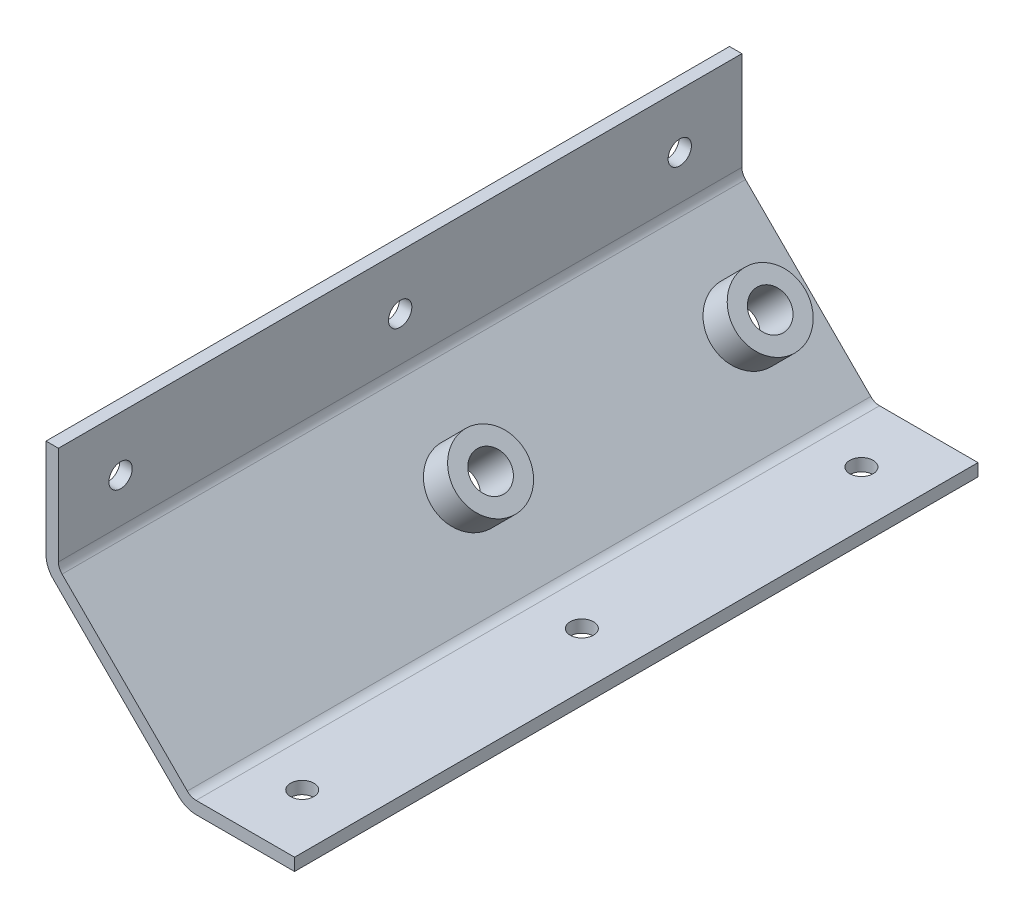
ISO-10303-21;
HEADER;
FILE_DESCRIPTION(('STEP AP214'),'2;1');
FILE_NAME('part.step','',(''),(''),'','','');
FILE_SCHEMA(('AUTOMOTIVE_DESIGN { 1 0 10303 214 1 1 1 1 }'));
ENDSEC;
DATA;
#1=APPLICATION_CONTEXT('core data for automotive mechanical design processes');
#2=APPLICATION_PROTOCOL_DEFINITION('international standard','automotive_design',2000,#1);
#3=PRODUCT_CONTEXT('',#1,'mechanical');
#4=PRODUCT('Part','Part','',(#3));
#5=PRODUCT_RELATED_PRODUCT_CATEGORY('part','',(#4));
#6=PRODUCT_DEFINITION_FORMATION('','',#4);
#7=PRODUCT_DEFINITION_CONTEXT('part definition',#1,'design');
#8=PRODUCT_DEFINITION('design','',#6,#7);
#9=PRODUCT_DEFINITION_SHAPE('','',#8);
#10=(LENGTH_UNIT() NAMED_UNIT(*) SI_UNIT(.MILLI.,.METRE.));
#11=(NAMED_UNIT(*) PLANE_ANGLE_UNIT() SI_UNIT($,.RADIAN.));
#12=(NAMED_UNIT(*) SI_UNIT($,.STERADIAN.) SOLID_ANGLE_UNIT());
#13=UNCERTAINTY_MEASURE_WITH_UNIT(LENGTH_MEASURE(1.E-05),#10,'distance_accuracy_value','');
#14=(GEOMETRIC_REPRESENTATION_CONTEXT(3) GLOBAL_UNCERTAINTY_ASSIGNED_CONTEXT((#13)) GLOBAL_UNIT_ASSIGNED_CONTEXT((#10,
#11,#12)) REPRESENTATION_CONTEXT('',''));
#15=CARTESIAN_POINT('',(0.,0.,0.));
#16=DIRECTION('',(0.,0.,1.));
#17=DIRECTION('',(1.,0.,0.));
#18=AXIS2_PLACEMENT_3D('',#15,#16,#17);
#19=CARTESIAN_POINT('',(5967.28975436411,-6613.31644877753,139.7));
#20=DIRECTION('',(-0.707106781186548,-0.707106781186548,0.));
#21=DIRECTION('',(0.707106781186548,-0.707106781186548,0.));
#22=AXIS2_PLACEMENT_3D('',#19,#20,#21);
#23=PLANE('',#22);
#24=CARTESIAN_POINT('',(5967.28975436284,-6613.31644877626,69.85));
#25=DIRECTION('',(-0.707106781186548,-0.707106781186548,0.));
#26=DIRECTION('',(0.707106781186548,-0.707106781186548,0.));
#27=AXIS2_PLACEMENT_3D('',#24,#25,#26);
#28=CIRCLE('',#27,7.17550000000023);
#29=CARTESIAN_POINT('',(5972.36359907124,-6618.39029348466,69.85));
#30=VERTEX_POINT('',#29);
#31=EDGE_CURVE('E141',#30,#30,#28,.F.);
#32=ORIENTED_EDGE('',*,*,#31,.F.);
#33=EDGE_LOOP('',(#32));
#34=FACE_BOUND('',#33,.T.);
#35=DIRECTION('',(-0.707106781186548,0.707106781186548,0.));
#36=VECTOR('',#35,1.);
#37=CARTESIAN_POINT('',(5967.28975436411,-6613.31644877753,0.));
#38=LINE('',#37,#36);
#39=CARTESIAN_POINT('',(5980.08935681206,-6626.11605122548,0.));
#40=VERTEX_POINT('',#39);
#41=CARTESIAN_POINT('',(5954.49015191489,-6600.51684632831,0.));
#42=VERTEX_POINT('',#41);
#43=EDGE_CURVE('E161',#40,#42,#38,.T.);
#44=ORIENTED_EDGE('',*,*,#43,.T.);
#45=DIRECTION('',(0.,0.,-1.));
#46=VECTOR('',#45,1.);
#47=CARTESIAN_POINT('',(5954.49015191489,-6600.51684632831,139.7));
#48=LINE('',#47,#46);
#49=CARTESIAN_POINT('',(5954.49015191489,-6600.51684632831,139.7));
#50=VERTEX_POINT('',#49);
#51=EDGE_CURVE('E195',#42,#50,#48,.F.);
#52=ORIENTED_EDGE('',*,*,#51,.T.);
#53=DIRECTION('',(-0.707106781186524,0.707106781186571,0.));
#54=VECTOR('',#53,1.);
#55=CARTESIAN_POINT('',(5967.28975436411,-6613.31644877753,139.7));
#56=LINE('',#55,#54);
#57=CARTESIAN_POINT('',(5980.08935681206,-6626.11605122548,139.7));
#58=VERTEX_POINT('',#57);
#59=EDGE_CURVE('E132',#58,#50,#56,.T.);
#60=ORIENTED_EDGE('',*,*,#59,.F.);
#61=DIRECTION('',(0.,0.,-1.));
#62=VECTOR('',#61,1.);
#63=CARTESIAN_POINT('',(5980.08935681206,-6626.11605122548,0.));
#64=LINE('',#63,#62);
#65=EDGE_CURVE('E192',#58,#40,#64,.T.);
#66=ORIENTED_EDGE('',*,*,#65,.T.);
#67=EDGE_LOOP('',(#44,#52,#60,#66));
#68=FACE_BOUND('',#67,.T.);
#69=CARTESIAN_POINT('',(5967.28975436284,-6613.31644877626,12.7));
#70=DIRECTION('',(-0.707106781186548,-0.707106781186548,0.));
#71=DIRECTION('',(0.707106781186548,-0.707106781186548,0.));
#72=AXIS2_PLACEMENT_3D('',#69,#70,#71);
#73=CIRCLE('',#72,7.17550000000023);
#74=CARTESIAN_POINT('',(5972.36359907124,-6618.39029348466,12.7));
#75=VERTEX_POINT('',#74);
#76=EDGE_CURVE('E187',#75,#75,#73,.F.);
#77=ORIENTED_EDGE('',*,*,#76,.F.);
#78=EDGE_LOOP('',(#77));
#79=FACE_BOUND('',#78,.T.);
#80=ADVANCED_FACE('F30',(#34,#68,#79),#23,.F.);
#81=CARTESIAN_POINT('',(5953.7462031391,-6578.6,139.7));
#82=DIRECTION('',(-1.,0.,0.));
#83=DIRECTION('',(0.,0.,1.));
#84=AXIS2_PLACEMENT_3D('',#81,#82,#83);
#85=PLANE('',#84);
#86=CARTESIAN_POINT('',(5953.7462031391,-6589.7252,12.7));
#87=DIRECTION('',(-1.,0.,0.));
#88=DIRECTION('',(0.,0.,1.));
#89=AXIS2_PLACEMENT_3D('',#86,#87,#88);
#90=CIRCLE('',#89,2.38759999999989);
#91=CARTESIAN_POINT('',(5953.7462031391,-6589.7252,15.0875999999999));
#92=VERTEX_POINT('',#91);
#93=EDGE_CURVE('E529',#92,#92,#90,.F.);
#94=ORIENTED_EDGE('',*,*,#93,.F.);
#95=EDGE_LOOP('',(#94));
#96=FACE_BOUND('',#95,.T.);
#97=CARTESIAN_POINT('',(5953.7462031391,-6589.7252,69.85));
#98=DIRECTION('',(-1.,0.,0.));
#99=DIRECTION('',(0.,0.,1.));
#100=AXIS2_PLACEMENT_3D('',#97,#98,#99);
#101=CIRCLE('',#100,2.3875999999999);
#102=CARTESIAN_POINT('',(5953.7462031391,-6589.7252,72.2375999999999));
#103=VERTEX_POINT('',#102);
#104=EDGE_CURVE('E523',#103,#103,#101,.F.);
#105=ORIENTED_EDGE('',*,*,#104,.F.);
#106=EDGE_LOOP('',(#105));
#107=FACE_BOUND('',#106,.T.);
#108=CARTESIAN_POINT('',(5953.7462031391,-6589.7252,127.));
#109=DIRECTION('',(-1.,0.,0.));
#110=DIRECTION('',(0.,0.,1.));
#111=AXIS2_PLACEMENT_3D('',#108,#109,#110);
#112=CIRCLE('',#111,2.38759999999988);
#113=CARTESIAN_POINT('',(5953.7462031391,-6589.7252,129.3876));
#114=VERTEX_POINT('',#113);
#115=EDGE_CURVE('E517',#114,#114,#112,.F.);
#116=ORIENTED_EDGE('',*,*,#115,.F.);
#117=EDGE_LOOP('',(#116));
#118=FACE_BOUND('',#117,.T.);
#119=DIRECTION('',(0.,1.,0.));
#120=VECTOR('',#119,1.);
#121=CARTESIAN_POINT('',(5953.7462031391,-6578.6,139.7));
#122=LINE('',#121,#120);
#123=CARTESIAN_POINT('',(5953.7462031391,-6598.72079510409,139.7));
#124=VERTEX_POINT('',#123);
#125=CARTESIAN_POINT('',(5953.7462031391,-6578.6,139.7));
#126=VERTEX_POINT('',#125);
#127=EDGE_CURVE('E120',#124,#126,#122,.T.);
#128=ORIENTED_EDGE('',*,*,#127,.F.);
#129=DIRECTION('',(0.,0.,-1.));
#130=VECTOR('',#129,1.);
#131=CARTESIAN_POINT('',(5953.7462031391,-6598.72079510409,0.));
#132=LINE('',#131,#130);
#133=CARTESIAN_POINT('',(5953.7462031391,-6598.72079510409,0.));
#134=VERTEX_POINT('',#133);
#135=EDGE_CURVE('E190',#124,#134,#132,.T.);
#136=ORIENTED_EDGE('',*,*,#135,.T.);
#137=DIRECTION('',(0.,1.,0.));
#138=VECTOR('',#137,1.);
#139=CARTESIAN_POINT('',(5953.7462031391,-6578.6,0.));
#140=LINE('',#139,#138);
#141=CARTESIAN_POINT('',(5953.7462031391,-6578.6,0.));
#142=VERTEX_POINT('',#141);
#143=EDGE_CURVE('E138',#134,#142,#140,.T.);
#144=ORIENTED_EDGE('',*,*,#143,.T.);
#145=DIRECTION('',(0.,0.,-1.));
#146=VECTOR('',#145,1.);
#147=CARTESIAN_POINT('',(5953.7462031391,-6578.6,139.7));
#148=LINE('',#147,#146);
#149=EDGE_CURVE('E135',#126,#142,#148,.T.);
#150=ORIENTED_EDGE('',*,*,#149,.F.);
#151=EDGE_LOOP('',(#128,#136,#144,#150));
#152=FACE_BOUND('',#151,.T.);
#153=ADVANCED_FACE('F136',(#96,#107,#118,#152),#85,.F.);
#154=CARTESIAN_POINT('',(5951.2062031391,-6578.6,139.7));
#155=DIRECTION('',(0.,-1.,0.));
#156=DIRECTION('',(0.,0.,-1.));
#157=AXIS2_PLACEMENT_3D('',#154,#155,#156);
#158=PLANE('',#157);
#159=DIRECTION('',(-1.,0.,0.));
#160=VECTOR('',#159,1.);
#161=CARTESIAN_POINT('',(5951.2062031391,-6578.6,0.));
#162=LINE('',#161,#160);
#163=CARTESIAN_POINT('',(5951.2062031391,-6578.6,0.));
#164=VERTEX_POINT('',#163);
#165=EDGE_CURVE('E166',#142,#164,#162,.T.);
#166=ORIENTED_EDGE('',*,*,#165,.T.);
#167=DIRECTION('',(0.,0.,-1.));
#168=VECTOR('',#167,1.);
#169=CARTESIAN_POINT('',(5951.2062031391,-6578.6,139.7));
#170=LINE('',#169,#168);
#171=CARTESIAN_POINT('',(5951.2062031391,-6578.6,139.7));
#172=VERTEX_POINT('',#171);
#173=EDGE_CURVE('E142',#172,#164,#170,.T.);
#174=ORIENTED_EDGE('',*,*,#173,.F.);
#175=DIRECTION('',(-1.,0.,0.));
#176=VECTOR('',#175,1.);
#177=CARTESIAN_POINT('',(5951.2062031391,-6578.6,139.7));
#178=LINE('',#177,#176);
#179=EDGE_CURVE('E124',#126,#172,#178,.T.);
#180=ORIENTED_EDGE('',*,*,#179,.F.);
#181=ORIENTED_EDGE('',*,*,#149,.T.);
#182=EDGE_LOOP('',(#166,#174,#180,#181));
#183=FACE_BOUND('',#182,.T.);
#184=ADVANCED_FACE('F144',(#183),#158,.F.);
#185=CARTESIAN_POINT('',(5951.2062031391,-6578.6,139.7));
#186=DIRECTION('',(1.,0.,0.));
#187=DIRECTION('',(0.,0.,-1.));
#188=AXIS2_PLACEMENT_3D('',#185,#186,#187);
#189=PLANE('',#188);
#190=CARTESIAN_POINT('',(5951.2062031391,-6589.7252,12.7));
#191=DIRECTION('',(-1.,0.,0.));
#192=DIRECTION('',(0.,0.,1.));
#193=AXIS2_PLACEMENT_3D('',#190,#191,#192);
#194=CIRCLE('',#193,2.38759999999989);
#195=CARTESIAN_POINT('',(5951.2062031391,-6589.7252,15.0875999999999));
#196=VERTEX_POINT('',#195);
#197=EDGE_CURVE('E532',#196,#196,#194,.T.);
#198=ORIENTED_EDGE('',*,*,#197,.F.);
#199=EDGE_LOOP('',(#198));
#200=FACE_BOUND('',#199,.T.);
#201=CARTESIAN_POINT('',(5951.2062031391,-6589.7252,69.85));
#202=DIRECTION('',(-1.,0.,0.));
#203=DIRECTION('',(0.,0.,1.));
#204=AXIS2_PLACEMENT_3D('',#201,#202,#203);
#205=CIRCLE('',#204,2.3875999999999);
#206=CARTESIAN_POINT('',(5951.2062031391,-6589.7252,72.2375999999999));
#207=VERTEX_POINT('',#206);
#208=EDGE_CURVE('E526',#207,#207,#205,.T.);
#209=ORIENTED_EDGE('',*,*,#208,.F.);
#210=EDGE_LOOP('',(#209));
#211=FACE_BOUND('',#210,.T.);
#212=CARTESIAN_POINT('',(5951.2062031391,-6589.7252,127.));
#213=DIRECTION('',(-1.,0.,0.));
#214=DIRECTION('',(0.,0.,1.));
#215=AXIS2_PLACEMENT_3D('',#212,#213,#214);
#216=CIRCLE('',#215,2.38759999999988);
#217=CARTESIAN_POINT('',(5951.2062031391,-6589.7252,129.3876));
#218=VERTEX_POINT('',#217);
#219=EDGE_CURVE('E520',#218,#218,#216,.T.);
#220=ORIENTED_EDGE('',*,*,#219,.F.);
#221=EDGE_LOOP('',(#220));
#222=FACE_BOUND('',#221,.T.);
#223=DIRECTION('',(0.,-1.,0.));
#224=VECTOR('',#223,1.);
#225=CARTESIAN_POINT('',(5951.2062031391,-6578.6,0.));
#226=LINE('',#225,#224);
#227=CARTESIAN_POINT('',(5951.2062031391,-6598.72079510314,0.));
#228=VERTEX_POINT('',#227);
#229=EDGE_CURVE('E168',#164,#228,#226,.T.);
#230=ORIENTED_EDGE('',*,*,#229,.T.);
#231=DIRECTION('',(0.,0.,-1.));
#232=VECTOR('',#231,1.);
#233=CARTESIAN_POINT('',(5951.2062031391,-6598.72079510314,139.7));
#234=LINE('',#233,#232);
#235=CARTESIAN_POINT('',(5951.2062031391,-6598.72079510314,139.7));
#236=VERTEX_POINT('',#235);
#237=EDGE_CURVE('E11',#228,#236,#234,.F.);
#238=ORIENTED_EDGE('',*,*,#237,.T.);
#239=DIRECTION('',(0.,-1.,0.));
#240=VECTOR('',#239,1.);
#241=CARTESIAN_POINT('',(5951.2062031391,-6578.6,139.7));
#242=LINE('',#241,#240);
#243=EDGE_CURVE('E146',#172,#236,#242,.T.);
#244=ORIENTED_EDGE('',*,*,#243,.F.);
#245=ORIENTED_EDGE('',*,*,#173,.T.);
#246=EDGE_LOOP('',(#230,#238,#244,#245));
#247=FACE_BOUND('',#246,.T.);
#248=ADVANCED_FACE('F237',(#200,#211,#222,#247),#189,.F.);
#249=CARTESIAN_POINT('',(5979.7812031391,-6629.4,139.7));
#250=DIRECTION('',(0.707106781186548,0.707106781186548,0.));
#251=DIRECTION('',(-0.707106781186548,0.707106781186548,0.));
#252=AXIS2_PLACEMENT_3D('',#249,#250,#251);
#253=PLANE('',#252);
#254=CARTESIAN_POINT('',(5965.4937031391,-6615.1125,12.7));
#255=DIRECTION('',(-0.707106781186548,-0.707106781186547,0.));
#256=DIRECTION('',(0.707106781186547,-0.707106781186548,0.));
#257=AXIS2_PLACEMENT_3D('',#254,#255,#256);
#258=CIRCLE('',#257,3.81000000000022);
#259=CARTESIAN_POINT('',(5968.18777997542,-6617.80657683632,12.7));
#260=VERTEX_POINT('',#259);
#261=EDGE_CURVE('E538',#260,#260,#258,.T.);
#262=ORIENTED_EDGE('',*,*,#261,.F.);
#263=EDGE_LOOP('',(#262));
#264=FACE_BOUND('',#263,.T.);
#265=CARTESIAN_POINT('',(5965.4937031391,-6615.1125,69.85));
#266=DIRECTION('',(-0.707106781186548,-0.707106781186547,0.));
#267=DIRECTION('',(0.707106781186547,-0.707106781186548,0.));
#268=AXIS2_PLACEMENT_3D('',#265,#266,#267);
#269=CIRCLE('',#268,3.81000000000022);
#270=CARTESIAN_POINT('',(5968.18777997542,-6617.80657683632,69.85));
#271=VERTEX_POINT('',#270);
#272=EDGE_CURVE('E535',#271,#271,#269,.T.);
#273=ORIENTED_EDGE('',*,*,#272,.F.);
#274=EDGE_LOOP('',(#273));
#275=FACE_BOUND('',#274,.T.);
#276=DIRECTION('',(0.707106781186547,-0.707106781186547,0.));
#277=VECTOR('',#276,1.);
#278=CARTESIAN_POINT('',(5979.7812031391,-6629.4,0.));
#279=LINE('',#278,#277);
#280=CARTESIAN_POINT('',(5952.69410069067,-6602.31289755157,0.));
#281=VERTEX_POINT('',#280);
#282=CARTESIAN_POINT('',(5978.29330558753,-6627.91210244843,0.));
#283=VERTEX_POINT('',#282);
#284=EDGE_CURVE('E170',#281,#283,#279,.T.);
#285=ORIENTED_EDGE('',*,*,#284,.T.);
#286=DIRECTION('',(0.,0.,-1.));
#287=VECTOR('',#286,1.);
#288=CARTESIAN_POINT('',(5978.29330558753,-6627.91210244843,139.7));
#289=LINE('',#288,#287);
#290=CARTESIAN_POINT('',(5978.29330558753,-6627.91210244843,139.7));
#291=VERTEX_POINT('',#290);
#292=EDGE_CURVE('E51',#283,#291,#289,.F.);
#293=ORIENTED_EDGE('',*,*,#292,.T.);
#294=DIRECTION('',(0.707106781186547,-0.707106781186547,0.));
#295=VECTOR('',#294,1.);
#296=CARTESIAN_POINT('',(5979.7812031391,-6629.4,139.7));
#297=LINE('',#296,#295);
#298=CARTESIAN_POINT('',(5952.69410069067,-6602.31289755157,139.7));
#299=VERTEX_POINT('',#298);
#300=EDGE_CURVE('E148',#299,#291,#297,.T.);
#301=ORIENTED_EDGE('',*,*,#300,.F.);
#302=DIRECTION('',(0.,0.,-1.));
#303=VECTOR('',#302,1.);
#304=CARTESIAN_POINT('',(5952.69410069067,-6602.31289755157,139.7));
#305=LINE('',#304,#303);
#306=EDGE_CURVE('E213',#299,#281,#305,.T.);
#307=ORIENTED_EDGE('',*,*,#306,.T.);
#308=EDGE_LOOP('',(#285,#293,#301,#307));
#309=FACE_BOUND('',#308,.T.);
#310=ADVANCED_FACE('F232',(#264,#275,#309),#253,.F.);
#311=CARTESIAN_POINT('',(5979.7812031391,-6629.4,139.7));
#312=DIRECTION('',(0.,1.,0.));
#313=DIRECTION('',(0.,0.,1.));
#314=AXIS2_PLACEMENT_3D('',#311,#312,#313);
#315=PLANE('',#314);
#316=CARTESIAN_POINT('',(5990.8810031391,-6629.4,12.7));
#317=DIRECTION('',(0.,-1.,0.));
#318=DIRECTION('',(0.,0.,-1.));
#319=AXIS2_PLACEMENT_3D('',#316,#317,#318);
#320=CIRCLE('',#319,2.38759999999948);
#321=CARTESIAN_POINT('',(5990.8810031391,-6629.4,10.3124000000005));
#322=VERTEX_POINT('',#321);
#323=EDGE_CURVE('E514',#322,#322,#320,.T.);
#324=ORIENTED_EDGE('',*,*,#323,.F.);
#325=EDGE_LOOP('',(#324));
#326=FACE_BOUND('',#325,.T.);
#327=CARTESIAN_POINT('',(5990.8810031391,-6629.4,69.85));
#328=DIRECTION('',(0.,-1.,0.));
#329=DIRECTION('',(0.,0.,-1.));
#330=AXIS2_PLACEMENT_3D('',#327,#328,#329);
#331=CIRCLE('',#330,2.38759999999948);
#332=CARTESIAN_POINT('',(5990.8810031391,-6629.4,67.4624000000005));
#333=VERTEX_POINT('',#332);
#334=EDGE_CURVE('E508',#333,#333,#331,.T.);
#335=ORIENTED_EDGE('',*,*,#334,.F.);
#336=EDGE_LOOP('',(#335));
#337=FACE_BOUND('',#336,.T.);
#338=CARTESIAN_POINT('',(5990.8810031391,-6629.4,127.));
#339=DIRECTION('',(0.,-1.,0.));
#340=DIRECTION('',(0.,0.,-1.));
#341=AXIS2_PLACEMENT_3D('',#338,#339,#340);
#342=CIRCLE('',#341,2.38759999999948);
#343=CARTESIAN_POINT('',(5990.8810031391,-6629.4,124.612400000001));
#344=VERTEX_POINT('',#343);
#345=EDGE_CURVE('E502',#344,#344,#342,.T.);
#346=ORIENTED_EDGE('',*,*,#345,.F.);
#347=EDGE_LOOP('',(#346));
#348=FACE_BOUND('',#347,.T.);
#349=DIRECTION('',(1.,0.,0.));
#350=VECTOR('',#349,1.);
#351=CARTESIAN_POINT('',(5979.7812031391,-6629.4,139.7));
#352=LINE('',#351,#350);
#353=CARTESIAN_POINT('',(5981.88540803595,-6629.4,139.7));
#354=VERTEX_POINT('',#353);
#355=CARTESIAN_POINT('',(6002.0062031391,-6629.4,139.7));
#356=VERTEX_POINT('',#355);
#357=EDGE_CURVE('E153',#354,#356,#352,.T.);
#358=ORIENTED_EDGE('',*,*,#357,.F.);
#359=DIRECTION('',(0.,0.,-1.));
#360=VECTOR('',#359,1.);
#361=CARTESIAN_POINT('',(5981.88540803595,-6629.4,139.7));
#362=LINE('',#361,#360);
#363=CARTESIAN_POINT('',(5981.88540803595,-6629.4,0.));
#364=VERTEX_POINT('',#363);
#365=EDGE_CURVE('E206',#354,#364,#362,.T.);
#366=ORIENTED_EDGE('',*,*,#365,.T.);
#367=DIRECTION('',(1.,0.,0.));
#368=VECTOR('',#367,1.);
#369=CARTESIAN_POINT('',(5979.7812031391,-6629.4,0.));
#370=LINE('',#369,#368);
#371=CARTESIAN_POINT('',(6002.0062031391,-6629.4,0.));
#372=VERTEX_POINT('',#371);
#373=EDGE_CURVE('E172',#364,#372,#370,.T.);
#374=ORIENTED_EDGE('',*,*,#373,.T.);
#375=DIRECTION('',(0.,0.,-1.));
#376=VECTOR('',#375,1.);
#377=CARTESIAN_POINT('',(6002.0062031391,-6629.4,139.7));
#378=LINE('',#377,#376);
#379=EDGE_CURVE('E181',#356,#372,#378,.T.);
#380=ORIENTED_EDGE('',*,*,#379,.F.);
#381=EDGE_LOOP('',(#358,#366,#374,#380));
#382=FACE_BOUND('',#381,.T.);
#383=ADVANCED_FACE('F224',(#326,#337,#348,#382),#315,.F.);
#384=CARTESIAN_POINT('',(6002.0062031391,-6626.86000000127,139.7));
#385=DIRECTION('',(-1.,0.,0.));
#386=DIRECTION('',(0.,0.,1.));
#387=AXIS2_PLACEMENT_3D('',#384,#385,#386);
#388=PLANE('',#387);
#389=DIRECTION('',(0.,1.,0.));
#390=VECTOR('',#389,1.);
#391=CARTESIAN_POINT('',(6002.0062031391,-6626.86000000127,0.));
#392=LINE('',#391,#390);
#393=CARTESIAN_POINT('',(6002.0062031391,-6626.86000000127,0.));
#394=VERTEX_POINT('',#393);
#395=EDGE_CURVE('E174',#372,#394,#392,.T.);
#396=ORIENTED_EDGE('',*,*,#395,.T.);
#397=DIRECTION('',(0.,0.,-1.));
#398=VECTOR('',#397,1.);
#399=CARTESIAN_POINT('',(6002.0062031391,-6626.86000000127,139.7));
#400=LINE('',#399,#398);
#401=CARTESIAN_POINT('',(6002.0062031391,-6626.86000000127,139.7));
#402=VERTEX_POINT('',#401);
#403=EDGE_CURVE('E160',#402,#394,#400,.T.);
#404=ORIENTED_EDGE('',*,*,#403,.F.);
#405=DIRECTION('',(0.,1.,0.));
#406=VECTOR('',#405,1.);
#407=CARTESIAN_POINT('',(6002.0062031391,-6626.86000000127,139.7));
#408=LINE('',#407,#406);
#409=EDGE_CURVE('E155',#356,#402,#408,.T.);
#410=ORIENTED_EDGE('',*,*,#409,.F.);
#411=ORIENTED_EDGE('',*,*,#379,.T.);
#412=EDGE_LOOP('',(#396,#404,#410,#411));
#413=FACE_BOUND('',#412,.T.);
#414=ADVANCED_FACE('F311',(#413),#388,.F.);
#415=CARTESIAN_POINT('',(5980.83330558785,-6626.86000000127,139.7));
#416=DIRECTION('',(0.,-1.,0.));
#417=DIRECTION('',(0.,0.,-1.));
#418=AXIS2_PLACEMENT_3D('',#415,#416,#417);
#419=PLANE('',#418);
#420=CARTESIAN_POINT('',(5990.8810031391,-6626.86000000127,12.7));
#421=DIRECTION('',(0.,-1.,0.));
#422=DIRECTION('',(0.,0.,-1.));
#423=AXIS2_PLACEMENT_3D('',#420,#421,#422);
#424=CIRCLE('',#423,2.38759999999948);
#425=CARTESIAN_POINT('',(5990.8810031391,-6626.86000000127,10.3124000000005));
#426=VERTEX_POINT('',#425);
#427=EDGE_CURVE('E511',#426,#426,#424,.F.);
#428=ORIENTED_EDGE('',*,*,#427,.F.);
#429=EDGE_LOOP('',(#428));
#430=FACE_BOUND('',#429,.T.);
#431=CARTESIAN_POINT('',(5990.8810031391,-6626.86000000127,69.85));
#432=DIRECTION('',(0.,-1.,0.));
#433=DIRECTION('',(0.,0.,-1.));
#434=AXIS2_PLACEMENT_3D('',#431,#432,#433);
#435=CIRCLE('',#434,2.38759999999948);
#436=CARTESIAN_POINT('',(5990.8810031391,-6626.86000000127,67.4624000000005));
#437=VERTEX_POINT('',#436);
#438=EDGE_CURVE('E505',#437,#437,#435,.F.);
#439=ORIENTED_EDGE('',*,*,#438,.F.);
#440=EDGE_LOOP('',(#439));
#441=FACE_BOUND('',#440,.T.);
#442=CARTESIAN_POINT('',(5990.8810031391,-6626.86000000127,127.));
#443=DIRECTION('',(0.,-1.,0.));
#444=DIRECTION('',(0.,0.,-1.));
#445=AXIS2_PLACEMENT_3D('',#442,#443,#444);
#446=CIRCLE('',#445,2.38759999999948);
#447=CARTESIAN_POINT('',(5990.8810031391,-6626.86000000127,124.612400000001));
#448=VERTEX_POINT('',#447);
#449=EDGE_CURVE('E164',#448,#448,#446,.F.);
#450=ORIENTED_EDGE('',*,*,#449,.F.);
#451=EDGE_LOOP('',(#450));
#452=FACE_BOUND('',#451,.T.);
#453=DIRECTION('',(-1.,0.,0.));
#454=VECTOR('',#453,1.);
#455=CARTESIAN_POINT('',(5980.83330558785,-6626.86000000127,0.));
#456=LINE('',#455,#454);
#457=CARTESIAN_POINT('',(5981.88540803628,-6626.86000000127,0.));
#458=VERTEX_POINT('',#457);
#459=EDGE_CURVE('E176',#394,#458,#456,.T.);
#460=ORIENTED_EDGE('',*,*,#459,.T.);
#461=DIRECTION('',(0.,0.,-1.));
#462=VECTOR('',#461,1.);
#463=CARTESIAN_POINT('',(5981.88540803628,-6626.86000000127,139.7));
#464=LINE('',#463,#462);
#465=CARTESIAN_POINT('',(5981.88540803628,-6626.86000000127,139.7));
#466=VERTEX_POINT('',#465);
#467=EDGE_CURVE('E197',#458,#466,#464,.F.);
#468=ORIENTED_EDGE('',*,*,#467,.T.);
#469=DIRECTION('',(-1.,0.,0.));
#470=VECTOR('',#469,1.);
#471=CARTESIAN_POINT('',(5980.83330558785,-6626.86000000127,139.7));
#472=LINE('',#471,#470);
#473=EDGE_CURVE('E157',#402,#466,#472,.T.);
#474=ORIENTED_EDGE('',*,*,#473,.F.);
#475=ORIENTED_EDGE('',*,*,#403,.T.);
#476=EDGE_LOOP('',(#460,#468,#474,#475));
#477=FACE_BOUND('',#476,.T.);
#478=ADVANCED_FACE('F300',(#430,#441,#452,#477),#419,.F.);
#479=CARTESIAN_POINT('',(5980.83330558785,-6626.86000000127,139.7));
#480=DIRECTION('',(0.,0.,1.));
#481=DIRECTION('',(1.,0.,0.));
#482=AXIS2_PLACEMENT_3D('',#479,#480,#481);
#483=PLANE('',#482);
#484=ORIENTED_EDGE('',*,*,#300,.T.);
#485=CARTESIAN_POINT('',(5981.88540803595,-6624.32,139.7));
#486=DIRECTION('',(0.,0.,1.));
#487=DIRECTION('',(1.,0.,0.));
#488=AXIS2_PLACEMENT_3D('',#485,#486,#487);
#489=CIRCLE('',#488,5.08);
#490=EDGE_CURVE('E38',#291,#354,#489,.T.);
#491=ORIENTED_EDGE('',*,*,#490,.T.);
#492=ORIENTED_EDGE('',*,*,#357,.T.);
#493=ORIENTED_EDGE('',*,*,#409,.T.);
#494=ORIENTED_EDGE('',*,*,#473,.T.);
#495=CARTESIAN_POINT('',(5981.88540803628,-6624.32000000127,139.7));
#496=DIRECTION('',(0.,0.,1.));
#497=DIRECTION('',(1.,0.,0.));
#498=AXIS2_PLACEMENT_3D('',#495,#496,#497);
#499=CIRCLE('',#498,2.54);
#500=EDGE_CURVE('E204',#466,#58,#499,.F.);
#501=ORIENTED_EDGE('',*,*,#500,.T.);
#502=ORIENTED_EDGE('',*,*,#59,.T.);
#503=CARTESIAN_POINT('',(5956.2862031391,-6598.72079510409,139.7));
#504=DIRECTION('',(0.,0.,1.));
#505=DIRECTION('',(1.,0.,0.));
#506=AXIS2_PLACEMENT_3D('',#503,#504,#505);
#507=CIRCLE('',#506,2.54);
#508=EDGE_CURVE('E128',#50,#124,#507,.F.);
#509=ORIENTED_EDGE('',*,*,#508,.T.);
#510=ORIENTED_EDGE('',*,*,#127,.T.);
#511=ORIENTED_EDGE('',*,*,#179,.T.);
#512=ORIENTED_EDGE('',*,*,#243,.T.);
#513=CARTESIAN_POINT('',(5956.2862031391,-6598.72079510314,139.7));
#514=DIRECTION('',(0.,0.,1.));
#515=DIRECTION('',(1.,0.,0.));
#516=AXIS2_PLACEMENT_3D('',#513,#514,#515);
#517=CIRCLE('',#516,5.08);
#518=EDGE_CURVE('E217',#236,#299,#517,.T.);
#519=ORIENTED_EDGE('',*,*,#518,.T.);
#520=EDGE_LOOP('',(#484,#491,#492,#493,#494,#501,#502,#509,#510,#511,#512,#519));
#521=FACE_BOUND('',#520,.T.);
#522=ADVANCED_FACE('F122',(#521),#483,.T.);
#523=CARTESIAN_POINT('',(5980.83330558785,-6626.86000000127,0.));
#524=DIRECTION('',(0.,0.,1.));
#525=DIRECTION('',(1.,0.,0.));
#526=AXIS2_PLACEMENT_3D('',#523,#524,#525);
#527=PLANE('',#526);
#528=ORIENTED_EDGE('',*,*,#373,.F.);
#529=CARTESIAN_POINT('',(5981.88540803595,-6624.32,0.));
#530=DIRECTION('',(0.,0.,1.));
#531=DIRECTION('',(1.,0.,0.));
#532=AXIS2_PLACEMENT_3D('',#529,#530,#531);
#533=CIRCLE('',#532,5.08);
#534=EDGE_CURVE('E211',#364,#283,#533,.F.);
#535=ORIENTED_EDGE('',*,*,#534,.T.);
#536=ORIENTED_EDGE('',*,*,#284,.F.);
#537=CARTESIAN_POINT('',(5956.2862031391,-6598.72079510314,0.));
#538=DIRECTION('',(0.,0.,1.));
#539=DIRECTION('',(1.,0.,0.));
#540=AXIS2_PLACEMENT_3D('',#537,#538,#539);
#541=CIRCLE('',#540,5.08);
#542=EDGE_CURVE('E209',#281,#228,#541,.F.);
#543=ORIENTED_EDGE('',*,*,#542,.T.);
#544=ORIENTED_EDGE('',*,*,#229,.F.);
#545=ORIENTED_EDGE('',*,*,#165,.F.);
#546=ORIENTED_EDGE('',*,*,#143,.F.);
#547=CARTESIAN_POINT('',(5956.2862031391,-6598.72079510409,0.));
#548=DIRECTION('',(0.,0.,1.));
#549=DIRECTION('',(1.,0.,0.));
#550=AXIS2_PLACEMENT_3D('',#547,#548,#549);
#551=CIRCLE('',#550,2.54);
#552=EDGE_CURVE('E199',#134,#42,#551,.T.);
#553=ORIENTED_EDGE('',*,*,#552,.T.);
#554=ORIENTED_EDGE('',*,*,#43,.F.);
#555=CARTESIAN_POINT('',(5981.88540803628,-6624.32000000127,0.));
#556=DIRECTION('',(0.,0.,1.));
#557=DIRECTION('',(1.,0.,0.));
#558=AXIS2_PLACEMENT_3D('',#555,#556,#557);
#559=CIRCLE('',#558,2.54);
#560=EDGE_CURVE('E202',#40,#458,#559,.T.);
#561=ORIENTED_EDGE('',*,*,#560,.T.);
#562=ORIENTED_EDGE('',*,*,#459,.F.);
#563=ORIENTED_EDGE('',*,*,#395,.F.);
#564=EDGE_LOOP('',(#528,#535,#536,#543,#544,#545,#546,#553,#554,#561,#562,#563));
#565=FACE_BOUND('',#564,.T.);
#566=ADVANCED_FACE('F230',(#565),#527,.F.);
#567=CARTESIAN_POINT('',(5990.8810031391,-6620.10684739823,127.));
#568=DIRECTION('',(0.,-1.,0.));
#569=DIRECTION('',(0.,0.,-1.));
#570=AXIS2_PLACEMENT_3D('',#567,#568,#569);
#571=CYLINDRICAL_SURFACE('',#570,2.38759999999948);
#572=ORIENTED_EDGE('',*,*,#449,.T.);
#573=EDGE_LOOP('',(#572));
#574=FACE_BOUND('',#573,.T.);
#575=ORIENTED_EDGE('',*,*,#345,.T.);
#576=EDGE_LOOP('',(#575));
#577=FACE_BOUND('',#576,.T.);
#578=ADVANCED_FACE('F289',(#574,#577),#571,.F.);
#579=CARTESIAN_POINT('',(5990.8810031391,-6620.10684739823,69.85));
#580=DIRECTION('',(0.,-1.,0.));
#581=DIRECTION('',(0.,0.,-1.));
#582=AXIS2_PLACEMENT_3D('',#579,#580,#581);
#583=CYLINDRICAL_SURFACE('',#582,2.38759999999948);
#584=ORIENTED_EDGE('',*,*,#438,.T.);
#585=EDGE_LOOP('',(#584));
#586=FACE_BOUND('',#585,.T.);
#587=ORIENTED_EDGE('',*,*,#334,.T.);
#588=EDGE_LOOP('',(#587));
#589=FACE_BOUND('',#588,.T.);
#590=ADVANCED_FACE('F455',(#586,#589),#583,.F.);
#591=CARTESIAN_POINT('',(5990.8810031391,-6620.10684739823,12.7));
#592=DIRECTION('',(0.,-1.,0.));
#593=DIRECTION('',(0.,0.,-1.));
#594=AXIS2_PLACEMENT_3D('',#591,#592,#593);
#595=CYLINDRICAL_SURFACE('',#594,2.38759999999948);
#596=ORIENTED_EDGE('',*,*,#427,.T.);
#597=EDGE_LOOP('',(#596));
#598=FACE_BOUND('',#597,.T.);
#599=ORIENTED_EDGE('',*,*,#323,.T.);
#600=EDGE_LOOP('',(#599));
#601=FACE_BOUND('',#600,.T.);
#602=ADVANCED_FACE('F445',(#598,#601),#595,.F.);
#603=CARTESIAN_POINT('',(5960.49935574214,-6589.7252,127.));
#604=DIRECTION('',(-1.,0.,0.));
#605=DIRECTION('',(0.,0.,1.));
#606=AXIS2_PLACEMENT_3D('',#603,#604,#605);
#607=CYLINDRICAL_SURFACE('',#606,2.38759999999988);
#608=ORIENTED_EDGE('',*,*,#115,.T.);
#609=EDGE_LOOP('',(#608));
#610=FACE_BOUND('',#609,.T.);
#611=ORIENTED_EDGE('',*,*,#219,.T.);
#612=EDGE_LOOP('',(#611));
#613=FACE_BOUND('',#612,.T.);
#614=ADVANCED_FACE('F435',(#610,#613),#607,.F.);
#615=CARTESIAN_POINT('',(5960.49935574214,-6589.7252,69.85));
#616=DIRECTION('',(-1.,0.,0.));
#617=DIRECTION('',(0.,0.,1.));
#618=AXIS2_PLACEMENT_3D('',#615,#616,#617);
#619=CYLINDRICAL_SURFACE('',#618,2.3875999999999);
#620=ORIENTED_EDGE('',*,*,#104,.T.);
#621=EDGE_LOOP('',(#620));
#622=FACE_BOUND('',#621,.T.);
#623=ORIENTED_EDGE('',*,*,#208,.T.);
#624=EDGE_LOOP('',(#623));
#625=FACE_BOUND('',#624,.T.);
#626=ADVANCED_FACE('F425',(#622,#625),#619,.F.);
#627=CARTESIAN_POINT('',(5960.49935574214,-6589.7252,12.7));
#628=DIRECTION('',(-1.,0.,0.));
#629=DIRECTION('',(0.,0.,1.));
#630=AXIS2_PLACEMENT_3D('',#627,#628,#629);
#631=CYLINDRICAL_SURFACE('',#630,2.38759999999989);
#632=ORIENTED_EDGE('',*,*,#93,.T.);
#633=EDGE_LOOP('',(#632));
#634=FACE_BOUND('',#633,.T.);
#635=ORIENTED_EDGE('',*,*,#197,.T.);
#636=EDGE_LOOP('',(#635));
#637=FACE_BOUND('',#636,.T.);
#638=ADVANCED_FACE('F414',(#634,#637),#631,.F.);
#639=CARTESIAN_POINT('',(5974.90975436284,-6605.69644877626,69.85));
#640=DIRECTION('',(-0.707106781186548,-0.707106781186547,0.));
#641=DIRECTION('',(0.707106781186547,-0.707106781186548,0.));
#642=AXIS2_PLACEMENT_3D('',#639,#640,#641);
#643=CYLINDRICAL_SURFACE('',#642,3.81000000000022);
#644=ORIENTED_EDGE('',*,*,#272,.T.);
#645=EDGE_LOOP('',(#644));
#646=FACE_BOUND('',#645,.T.);
#647=CARTESIAN_POINT('',(5972.22889522942,-6608.37730790967,69.85));
#648=DIRECTION('',(0.707106781186548,0.707106781186547,0.));
#649=DIRECTION('',(-0.707106781186547,0.707106781186548,0.));
#650=AXIS2_PLACEMENT_3D('',#647,#648,#649);
#651=CIRCLE('',#650,3.81000000000069);
#652=CARTESIAN_POINT('',(5969.5348183931,-6605.68323107335,69.85));
#653=VERTEX_POINT('',#652);
#654=EDGE_CURVE('E544',#653,#653,#651,.T.);
#655=ORIENTED_EDGE('',*,*,#654,.T.);
#656=EDGE_LOOP('',(#655));
#657=FACE_BOUND('',#656,.T.);
#658=ADVANCED_FACE('F404',(#646,#657),#643,.F.);
#659=CARTESIAN_POINT('',(5974.90975436284,-6605.69644877626,12.7));
#660=DIRECTION('',(-0.707106781186548,-0.707106781186547,0.));
#661=DIRECTION('',(0.707106781186547,-0.707106781186548,0.));
#662=AXIS2_PLACEMENT_3D('',#659,#660,#661);
#663=CYLINDRICAL_SURFACE('',#662,3.81000000000022);
#664=ORIENTED_EDGE('',*,*,#261,.T.);
#665=EDGE_LOOP('',(#664));
#666=FACE_BOUND('',#665,.T.);
#667=CARTESIAN_POINT('',(5972.22889522942,-6608.37730790967,12.7));
#668=DIRECTION('',(0.707106781186548,0.707106781186547,0.));
#669=DIRECTION('',(-0.707106781186547,0.707106781186548,0.));
#670=AXIS2_PLACEMENT_3D('',#667,#668,#669);
#671=CIRCLE('',#670,3.81000000000081);
#672=CARTESIAN_POINT('',(5969.5348183931,-6605.68323107335,12.7));
#673=VERTEX_POINT('',#672);
#674=EDGE_CURVE('E550',#673,#673,#671,.T.);
#675=ORIENTED_EDGE('',*,*,#674,.T.);
#676=EDGE_LOOP('',(#675));
#677=FACE_BOUND('',#676,.T.);
#678=ADVANCED_FACE('F394',(#666,#677),#663,.F.);
#679=CARTESIAN_POINT('',(5972.22889522942,-6608.37730790967,69.85));
#680=DIRECTION('',(0.707106781186548,0.707106781186547,0.));
#681=DIRECTION('',(-0.707106781186547,0.707106781186548,0.));
#682=AXIS2_PLACEMENT_3D('',#679,#680,#681);
#683=PLANE('',#682);
#684=CARTESIAN_POINT('',(5972.22889522942,-6608.37730790967,69.85));
#685=DIRECTION('',(0.707106781186548,0.707106781186547,0.));
#686=DIRECTION('',(-0.707106781186547,0.707106781186548,0.));
#687=AXIS2_PLACEMENT_3D('',#684,#685,#686);
#688=CIRCLE('',#687,7.17550000000023);
#689=CARTESIAN_POINT('',(5967.15505052102,-6603.30346320127,69.85));
#690=VERTEX_POINT('',#689);
#691=EDGE_CURVE('E541',#690,#690,#688,.T.);
#692=ORIENTED_EDGE('',*,*,#691,.T.);
#693=EDGE_LOOP('',(#692));
#694=FACE_BOUND('',#693,.T.);
#695=ORIENTED_EDGE('',*,*,#654,.F.);
#696=EDGE_LOOP('',(#695));
#697=FACE_BOUND('',#696,.T.);
#698=ADVANCED_FACE('F384',(#694,#697),#683,.T.);
#699=CARTESIAN_POINT('',(5972.22889522942,-6608.37730790967,69.85));
#700=DIRECTION('',(-0.707106781186548,-0.707106781186547,0.));
#701=DIRECTION('',(0.707106781186547,-0.707106781186548,0.));
#702=AXIS2_PLACEMENT_3D('',#699,#700,#701);
#703=CYLINDRICAL_SURFACE('',#702,7.17550000000023);
#704=ORIENTED_EDGE('',*,*,#691,.F.);
#705=EDGE_LOOP('',(#704));
#706=FACE_BOUND('',#705,.T.);
#707=ORIENTED_EDGE('',*,*,#31,.T.);
#708=EDGE_LOOP('',(#707));
#709=FACE_BOUND('',#708,.T.);
#710=ADVANCED_FACE('F374',(#706,#709),#703,.T.);
#711=CARTESIAN_POINT('',(5972.22889522942,-6608.37730790967,12.7));
#712=DIRECTION('',(0.707106781186548,0.707106781186547,0.));
#713=DIRECTION('',(-0.707106781186547,0.707106781186548,0.));
#714=AXIS2_PLACEMENT_3D('',#711,#712,#713);
#715=PLANE('',#714);
#716=CARTESIAN_POINT('',(5972.22889522942,-6608.37730790967,12.7));
#717=DIRECTION('',(0.707106781186548,0.707106781186547,0.));
#718=DIRECTION('',(-0.707106781186547,0.707106781186548,0.));
#719=AXIS2_PLACEMENT_3D('',#716,#717,#718);
#720=CIRCLE('',#719,7.17550000000023);
#721=CARTESIAN_POINT('',(5967.15505052102,-6603.30346320127,12.7));
#722=VERTEX_POINT('',#721);
#723=EDGE_CURVE('E547',#722,#722,#720,.T.);
#724=ORIENTED_EDGE('',*,*,#723,.T.);
#725=EDGE_LOOP('',(#724));
#726=FACE_BOUND('',#725,.T.);
#727=ORIENTED_EDGE('',*,*,#674,.F.);
#728=EDGE_LOOP('',(#727));
#729=FACE_BOUND('',#728,.T.);
#730=ADVANCED_FACE('F364',(#726,#729),#715,.T.);
#731=CARTESIAN_POINT('',(5972.22889522942,-6608.37730790967,12.7));
#732=DIRECTION('',(-0.707106781186548,-0.707106781186547,0.));
#733=DIRECTION('',(0.707106781186547,-0.707106781186548,0.));
#734=AXIS2_PLACEMENT_3D('',#731,#732,#733);
#735=CYLINDRICAL_SURFACE('',#734,7.17550000000023);
#736=ORIENTED_EDGE('',*,*,#723,.F.);
#737=EDGE_LOOP('',(#736));
#738=FACE_BOUND('',#737,.T.);
#739=ORIENTED_EDGE('',*,*,#76,.T.);
#740=EDGE_LOOP('',(#739));
#741=FACE_BOUND('',#740,.T.);
#742=ADVANCED_FACE('F265',(#738,#741),#735,.T.);
#743=CARTESIAN_POINT('',(5956.2862031391,-6598.72079510409,139.7));
#744=DIRECTION('',(0.,0.,1.));
#745=DIRECTION('',(1.,0.,0.));
#746=AXIS2_PLACEMENT_3D('',#743,#744,#745);
#747=CYLINDRICAL_SURFACE('',#746,2.54);
#748=ORIENTED_EDGE('',*,*,#508,.F.);
#749=ORIENTED_EDGE('',*,*,#51,.F.);
#750=ORIENTED_EDGE('',*,*,#552,.F.);
#751=ORIENTED_EDGE('',*,*,#135,.F.);
#752=EDGE_LOOP('',(#748,#749,#750,#751));
#753=FACE_BOUND('',#752,.T.);
#754=ADVANCED_FACE('F261',(#753),#747,.F.);
#755=CARTESIAN_POINT('',(5981.88540803628,-6624.32000000127,139.7));
#756=DIRECTION('',(0.,0.,1.));
#757=DIRECTION('',(1.,0.,0.));
#758=AXIS2_PLACEMENT_3D('',#755,#756,#757);
#759=CYLINDRICAL_SURFACE('',#758,2.54);
#760=ORIENTED_EDGE('',*,*,#500,.F.);
#761=ORIENTED_EDGE('',*,*,#467,.F.);
#762=ORIENTED_EDGE('',*,*,#560,.F.);
#763=ORIENTED_EDGE('',*,*,#65,.F.);
#764=EDGE_LOOP('',(#760,#761,#762,#763));
#765=FACE_BOUND('',#764,.T.);
#766=ADVANCED_FACE('F264',(#765),#759,.F.);
#767=CARTESIAN_POINT('',(5981.88540803595,-6624.32,139.7));
#768=DIRECTION('',(0.,0.,-1.));
#769=DIRECTION('',(-1.,0.,0.));
#770=AXIS2_PLACEMENT_3D('',#767,#768,#769);
#771=CYLINDRICAL_SURFACE('',#770,5.08);
#772=ORIENTED_EDGE('',*,*,#490,.F.);
#773=ORIENTED_EDGE('',*,*,#292,.F.);
#774=ORIENTED_EDGE('',*,*,#534,.F.);
#775=ORIENTED_EDGE('',*,*,#365,.F.);
#776=EDGE_LOOP('',(#772,#773,#774,#775));
#777=FACE_BOUND('',#776,.T.);
#778=ADVANCED_FACE('F227',(#777),#771,.T.);
#779=CARTESIAN_POINT('',(5956.2862031391,-6598.72079510314,139.7));
#780=DIRECTION('',(0.,0.,-1.));
#781=DIRECTION('',(-1.,0.,0.));
#782=AXIS2_PLACEMENT_3D('',#779,#780,#781);
#783=CYLINDRICAL_SURFACE('',#782,5.08);
#784=ORIENTED_EDGE('',*,*,#518,.F.);
#785=ORIENTED_EDGE('',*,*,#237,.F.);
#786=ORIENTED_EDGE('',*,*,#542,.F.);
#787=ORIENTED_EDGE('',*,*,#306,.F.);
#788=EDGE_LOOP('',(#784,#785,#786,#787));
#789=FACE_BOUND('',#788,.T.);
#790=ADVANCED_FACE('F32',(#789),#783,.T.);
#791=CLOSED_SHELL('',(#80,#153,#184,#248,#310,#383,#414,#478,#522,#566,#578,#590,#602,#614,#626,
#638,#658,#678,#698,#710,#730,#742,#754,#766,#778,#790));
#792=MANIFOLD_SOLID_BREP('B2',#791);
#793=ADVANCED_BREP_SHAPE_REPRESENTATION('',(#18,#792),#14);
#794=SHAPE_DEFINITION_REPRESENTATION(#9,#793);
ENDSEC;
END-ISO-10303-21;
